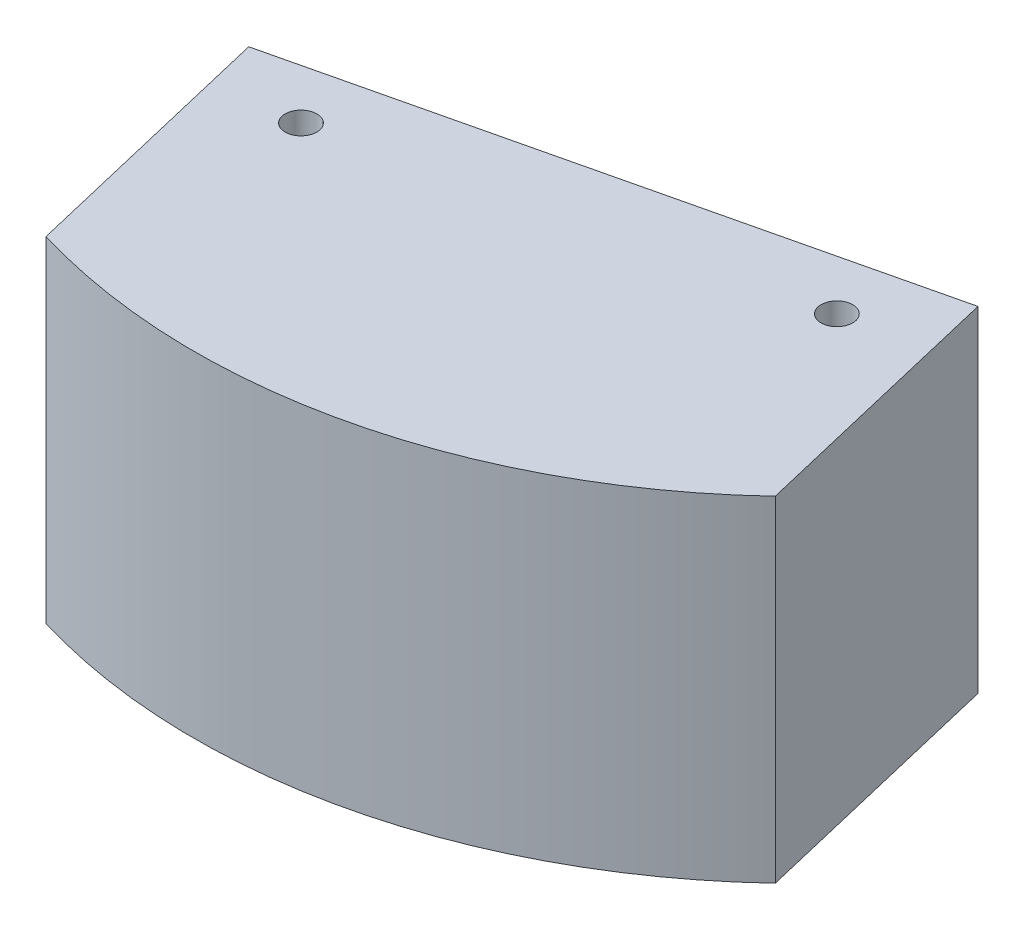
ISO-10303-21;
HEADER;
FILE_DESCRIPTION(('STEP AP214'),'2;1');
FILE_NAME('part.step','',(''),(''),'','','');
FILE_SCHEMA(('AUTOMOTIVE_DESIGN { 1 0 10303 214 1 1 1 1 }'));
ENDSEC;
DATA;
#1=APPLICATION_CONTEXT('core data for automotive mechanical design processes');
#2=APPLICATION_PROTOCOL_DEFINITION('international standard','automotive_design',2000,#1);
#3=PRODUCT_CONTEXT('',#1,'mechanical');
#4=PRODUCT('Part','Part','',(#3));
#5=PRODUCT_RELATED_PRODUCT_CATEGORY('part','',(#4));
#6=PRODUCT_DEFINITION_FORMATION('','',#4);
#7=PRODUCT_DEFINITION_CONTEXT('part definition',#1,'design');
#8=PRODUCT_DEFINITION('design','',#6,#7);
#9=PRODUCT_DEFINITION_SHAPE('','',#8);
#10=(LENGTH_UNIT() NAMED_UNIT(*) SI_UNIT(.MILLI.,.METRE.));
#11=(NAMED_UNIT(*) PLANE_ANGLE_UNIT() SI_UNIT($,.RADIAN.));
#12=(NAMED_UNIT(*) SI_UNIT($,.STERADIAN.) SOLID_ANGLE_UNIT());
#13=UNCERTAINTY_MEASURE_WITH_UNIT(LENGTH_MEASURE(1.E-05),#10,'distance_accuracy_value','');
#14=(GEOMETRIC_REPRESENTATION_CONTEXT(3) GLOBAL_UNCERTAINTY_ASSIGNED_CONTEXT((#13)) GLOBAL_UNIT_ASSIGNED_CONTEXT((#10,
#11,#12)) REPRESENTATION_CONTEXT('',''));
#15=CARTESIAN_POINT('',(0.,0.,0.));
#16=DIRECTION('',(0.,0.,1.));
#17=DIRECTION('',(1.,0.,0.));
#18=AXIS2_PLACEMENT_3D('',#15,#16,#17);
#19=CARTESIAN_POINT('',(0.,50.8,0.));
#20=DIRECTION('',(0.,-1.,0.));
#21=DIRECTION('',(0.,0.,-1.));
#22=AXIS2_PLACEMENT_3D('',#19,#20,#21);
#23=CYLINDRICAL_SURFACE('',#22,91.821);
#24=CARTESIAN_POINT('',(0.,0.,0.));
#25=DIRECTION('',(0.,1.,0.));
#26=DIRECTION('',(0.,0.,1.));
#27=AXIS2_PLACEMENT_3D('',#24,#25,#26);
#28=CIRCLE('',#27,91.821);
#29=CARTESIAN_POINT('',(-26.3260693042562,0.,87.9660964007583));
#30=VERTEX_POINT('',#29);
#31=CARTESIAN_POINT('',(63.0178395026787,0.,66.7820929996555));
#32=VERTEX_POINT('',#31);
#33=EDGE_CURVE('E100',#30,#32,#28,.T.);
#34=ORIENTED_EDGE('',*,*,#33,.T.);
#35=DIRECTION('',(0.,-1.,0.));
#36=VECTOR('',#35,1.);
#37=CARTESIAN_POINT('',(63.0178395026787,50.8,66.7820929996555));
#38=LINE('',#37,#36);
#39=CARTESIAN_POINT('',(63.0178395026787,50.8,66.7820929996555));
#40=VERTEX_POINT('',#39);
#41=EDGE_CURVE('E11',#40,#32,#38,.T.);
#42=ORIENTED_EDGE('',*,*,#41,.F.);
#43=CARTESIAN_POINT('',(0.,50.8,0.));
#44=DIRECTION('',(0.,1.,0.));
#45=DIRECTION('',(0.,0.,1.));
#46=AXIS2_PLACEMENT_3D('',#43,#44,#45);
#47=CIRCLE('',#46,91.821);
#48=CARTESIAN_POINT('',(-26.3260693042562,50.8,87.9660964007583));
#49=VERTEX_POINT('',#48);
#50=EDGE_CURVE('E88',#49,#40,#47,.T.);
#51=ORIENTED_EDGE('',*,*,#50,.F.);
#52=DIRECTION('',(0.,-1.,0.));
#53=VECTOR('',#52,1.);
#54=CARTESIAN_POINT('',(-26.3260693042562,50.8,87.9660964007583));
#55=LINE('',#54,#53);
#56=EDGE_CURVE('E96',#49,#30,#55,.T.);
#57=ORIENTED_EDGE('',*,*,#56,.T.);
#58=EDGE_LOOP('',(#34,#42,#51,#57));
#59=FACE_BOUND('',#58,.T.);
#60=ADVANCED_FACE('F37',(#59),#23,.T.);
#61=CARTESIAN_POINT('',(63.0178395026787,50.8,66.7820929996555));
#62=DIRECTION('',(-0.973022607104429,0.,0.230709787533385));
#63=DIRECTION('',(0.230709787533385,0.,0.973022607104429));
#64=AXIS2_PLACEMENT_3D('',#61,#62,#63);
#65=PLANE('',#64);
#66=DIRECTION('',(-0.230709787533385,0.,-0.973022607104429));
#67=VECTOR('',#66,1.);
#68=CARTESIAN_POINT('',(63.0178395026787,0.,66.7820929996555));
#69=LINE('',#68,#67);
#70=CARTESIAN_POINT('',(53.4682054723514,0.,26.5063426709547));
#71=VERTEX_POINT('',#70);
#72=EDGE_CURVE('E92',#32,#71,#69,.T.);
#73=ORIENTED_EDGE('',*,*,#72,.T.);
#74=DIRECTION('',(0.,-1.,0.));
#75=VECTOR('',#74,1.);
#76=CARTESIAN_POINT('',(53.4682054723514,50.8,26.5063426709547));
#77=LINE('',#76,#75);
#78=CARTESIAN_POINT('',(53.4682054723514,50.8,26.5063426709547));
#79=VERTEX_POINT('',#78);
#80=EDGE_CURVE('E45',#79,#71,#77,.T.);
#81=ORIENTED_EDGE('',*,*,#80,.F.);
#82=DIRECTION('',(-0.230709787533385,0.,-0.973022607104429));
#83=VECTOR('',#82,1.);
#84=CARTESIAN_POINT('',(63.0178395026787,50.8,66.7820929996555));
#85=LINE('',#84,#83);
#86=EDGE_CURVE('E83',#40,#79,#85,.T.);
#87=ORIENTED_EDGE('',*,*,#86,.F.);
#88=ORIENTED_EDGE('',*,*,#41,.T.);
#89=EDGE_LOOP('',(#73,#81,#87,#88));
#90=FACE_BOUND('',#89,.T.);
#91=ADVANCED_FACE('F91',(#90),#65,.F.);
#92=CARTESIAN_POINT('',(53.4682054723514,50.8,26.5063426709547));
#93=DIRECTION('',(0.230709787533386,0.,0.973022607104429));
#94=DIRECTION('',(0.973022607104429,0.,-0.230709787533386));
#95=AXIS2_PLACEMENT_3D('',#92,#93,#94);
#96=PLANE('',#95);
#97=DIRECTION('',(-0.973022607104429,0.,0.230709787533386));
#98=VECTOR('',#97,1.);
#99=CARTESIAN_POINT('',(53.4682054723514,0.,26.5063426709547));
#100=LINE('',#99,#98);
#101=CARTESIAN_POINT('',(-35.8757033345835,0.,47.6903460720576));
#102=VERTEX_POINT('',#101);
#103=EDGE_CURVE('E70',#71,#102,#100,.T.);
#104=ORIENTED_EDGE('',*,*,#103,.T.);
#105=DIRECTION('',(0.,-1.,0.));
#106=VECTOR('',#105,1.);
#107=CARTESIAN_POINT('',(-35.8757033345835,50.8,47.6903460720576));
#108=LINE('',#107,#106);
#109=CARTESIAN_POINT('',(-35.8757033345835,50.8,47.6903460720576));
#110=VERTEX_POINT('',#109);
#111=EDGE_CURVE('E93',#110,#102,#108,.T.);
#112=ORIENTED_EDGE('',*,*,#111,.F.);
#113=DIRECTION('',(-0.973022607104429,0.,0.230709787533386));
#114=VECTOR('',#113,1.);
#115=CARTESIAN_POINT('',(53.4682054723514,50.8,26.5063426709547));
#116=LINE('',#115,#114);
#117=EDGE_CURVE('E86',#79,#110,#116,.T.);
#118=ORIENTED_EDGE('',*,*,#117,.F.);
#119=ORIENTED_EDGE('',*,*,#80,.T.);
#120=EDGE_LOOP('',(#104,#112,#118,#119));
#121=FACE_BOUND('',#120,.T.);
#122=ADVANCED_FACE('F94',(#121),#96,.F.);
#123=CARTESIAN_POINT('',(-35.8757033345835,50.8,47.6903460720576));
#124=DIRECTION('',(0.973022607104429,0.,-0.230709787533386));
#125=DIRECTION('',(-0.230709787533386,0.,-0.973022607104429));
#126=AXIS2_PLACEMENT_3D('',#123,#124,#125);
#127=PLANE('',#126);
#128=DIRECTION('',(0.230709787533386,0.,0.973022607104429));
#129=VECTOR('',#128,1.);
#130=CARTESIAN_POINT('',(-35.8757033345835,0.,47.6903460720576));
#131=LINE('',#130,#129);
#132=EDGE_CURVE('E76',#102,#30,#131,.T.);
#133=ORIENTED_EDGE('',*,*,#132,.T.);
#134=ORIENTED_EDGE('',*,*,#56,.F.);
#135=DIRECTION('',(0.230709787533386,0.,0.973022607104429));
#136=VECTOR('',#135,1.);
#137=CARTESIAN_POINT('',(-35.8757033345835,50.8,47.6903460720576));
#138=LINE('',#137,#136);
#139=EDGE_CURVE('E53',#110,#49,#138,.T.);
#140=ORIENTED_EDGE('',*,*,#139,.F.);
#141=ORIENTED_EDGE('',*,*,#111,.T.);
#142=EDGE_LOOP('',(#133,#134,#140,#141));
#143=FACE_BOUND('',#142,.T.);
#144=ADVANCED_FACE('F108',(#143),#127,.F.);
#145=CARTESIAN_POINT('',(0.,50.8,0.));
#146=DIRECTION('',(0.,1.,0.));
#147=DIRECTION('',(0.,0.,1.));
#148=AXIS2_PLACEMENT_3D('',#145,#146,#147);
#149=PLANE('',#148);
#150=CARTESIAN_POINT('',(-21.9121698297843,50.8,53.7361830958897));
#151=DIRECTION('',(0.,1.,0.));
#152=DIRECTION('',(0.,0.,1.));
#153=AXIS2_PLACEMENT_3D('',#150,#151,#152);
#154=CIRCLE('',#153,2.40029999999999);
#155=CARTESIAN_POINT('',(-21.9121698297843,50.8,56.1364830958897));
#156=VERTEX_POINT('',#155);
#157=EDGE_CURVE('E122',#156,#156,#154,.T.);
#158=ORIENTED_EDGE('',*,*,#157,.F.);
#159=EDGE_LOOP('',(#158));
#160=FACE_BOUND('',#159,.T.);
#161=CARTESIAN_POINT('',(43.7426279923137,50.8,38.1690175559021));
#162=DIRECTION('',(0.,1.,0.));
#163=DIRECTION('',(0.,0.,1.));
#164=AXIS2_PLACEMENT_3D('',#161,#162,#163);
#165=CIRCLE('',#164,2.40029999999999);
#166=CARTESIAN_POINT('',(43.7426279923137,50.8,40.5693175559021));
#167=VERTEX_POINT('',#166);
#168=EDGE_CURVE('E116',#167,#167,#165,.T.);
#169=ORIENTED_EDGE('',*,*,#168,.F.);
#170=EDGE_LOOP('',(#169));
#171=FACE_BOUND('',#170,.T.);
#172=ORIENTED_EDGE('',*,*,#50,.T.);
#173=ORIENTED_EDGE('',*,*,#86,.T.);
#174=ORIENTED_EDGE('',*,*,#117,.T.);
#175=ORIENTED_EDGE('',*,*,#139,.T.);
#176=EDGE_LOOP('',(#172,#173,#174,#175));
#177=FACE_BOUND('',#176,.T.);
#178=ADVANCED_FACE('F84',(#160,#171,#177),#149,.T.);
#179=CARTESIAN_POINT('',(0.,0.,0.));
#180=DIRECTION('',(0.,1.,0.));
#181=DIRECTION('',(0.,0.,1.));
#182=AXIS2_PLACEMENT_3D('',#179,#180,#181);
#183=PLANE('',#182);
#184=CARTESIAN_POINT('',(-21.9121698297843,0.,53.7361830958897));
#185=DIRECTION('',(0.,1.,0.));
#186=DIRECTION('',(0.,0.,1.));
#187=AXIS2_PLACEMENT_3D('',#184,#185,#186);
#188=CIRCLE('',#187,2.40029999999999);
#189=CARTESIAN_POINT('',(-21.9121698297843,0.,56.1364830958897));
#190=VERTEX_POINT('',#189);
#191=EDGE_CURVE('E119',#190,#190,#188,.T.);
#192=ORIENTED_EDGE('',*,*,#191,.T.);
#193=EDGE_LOOP('',(#192));
#194=FACE_BOUND('',#193,.T.);
#195=CARTESIAN_POINT('',(43.7426279923137,0.,38.1690175559021));
#196=DIRECTION('',(0.,1.,0.));
#197=DIRECTION('',(0.,0.,1.));
#198=AXIS2_PLACEMENT_3D('',#195,#196,#197);
#199=CIRCLE('',#198,2.40029999999999);
#200=CARTESIAN_POINT('',(43.7426279923137,0.,40.5693175559021));
#201=VERTEX_POINT('',#200);
#202=EDGE_CURVE('E103',#201,#201,#199,.T.);
#203=ORIENTED_EDGE('',*,*,#202,.T.);
#204=EDGE_LOOP('',(#203));
#205=FACE_BOUND('',#204,.T.);
#206=ORIENTED_EDGE('',*,*,#33,.F.);
#207=ORIENTED_EDGE('',*,*,#132,.F.);
#208=ORIENTED_EDGE('',*,*,#103,.F.);
#209=ORIENTED_EDGE('',*,*,#72,.F.);
#210=EDGE_LOOP('',(#206,#207,#208,#209));
#211=FACE_BOUND('',#210,.T.);
#212=ADVANCED_FACE('F111',(#194,#205,#211),#183,.F.);
#213=CARTESIAN_POINT('',(43.7426279923137,50.8,38.1690175559021));
#214=DIRECTION('',(0.,1.,0.));
#215=DIRECTION('',(0.,0.,1.));
#216=AXIS2_PLACEMENT_3D('',#213,#214,#215);
#217=CYLINDRICAL_SURFACE('',#216,2.40029999999999);
#218=ORIENTED_EDGE('',*,*,#202,.F.);
#219=EDGE_LOOP('',(#218));
#220=FACE_BOUND('',#219,.T.);
#221=ORIENTED_EDGE('',*,*,#168,.T.);
#222=EDGE_LOOP('',(#221));
#223=FACE_BOUND('',#222,.T.);
#224=ADVANCED_FACE('F133',(#220,#223),#217,.F.);
#225=CARTESIAN_POINT('',(-21.9121698297843,50.8,53.7361830958897));
#226=DIRECTION('',(0.,1.,0.));
#227=DIRECTION('',(0.,0.,1.));
#228=AXIS2_PLACEMENT_3D('',#225,#226,#227);
#229=CYLINDRICAL_SURFACE('',#228,2.40029999999999);
#230=ORIENTED_EDGE('',*,*,#191,.F.);
#231=EDGE_LOOP('',(#230));
#232=FACE_BOUND('',#231,.T.);
#233=ORIENTED_EDGE('',*,*,#157,.T.);
#234=EDGE_LOOP('',(#233));
#235=FACE_BOUND('',#234,.T.);
#236=ADVANCED_FACE('F126',(#232,#235),#229,.F.);
#237=CLOSED_SHELL('',(#60,#91,#122,#144,#178,#212,#224,#236));
#238=MANIFOLD_SOLID_BREP('B2',#237);
#239=ADVANCED_BREP_SHAPE_REPRESENTATION('',(#18,#238),#14);
#240=SHAPE_DEFINITION_REPRESENTATION(#9,#239);
ENDSEC;
END-ISO-10303-21;
